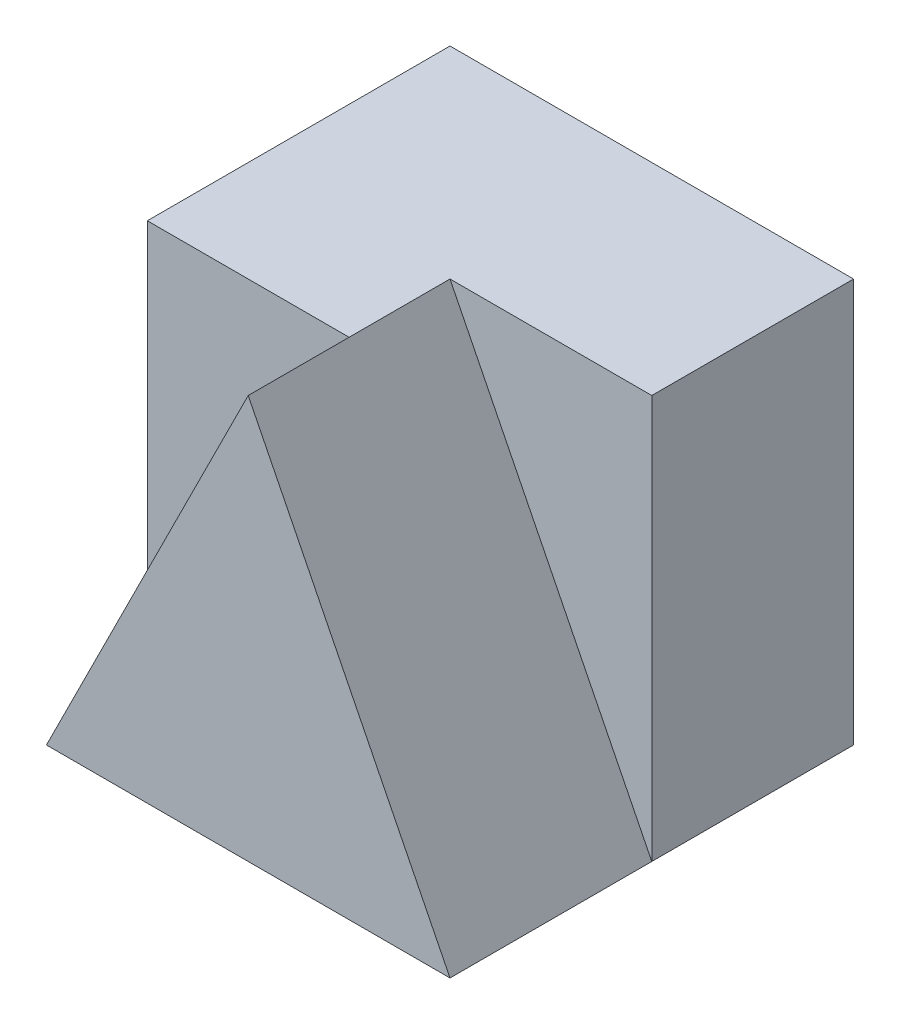
ISO-10303-21;
HEADER;
FILE_DESCRIPTION(('STEP AP214'),'2;1');
FILE_NAME('part.step','',(''),(''),'','','');
FILE_SCHEMA(('AUTOMOTIVE_DESIGN { 1 0 10303 214 1 1 1 1 }'));
ENDSEC;
DATA;
#1=APPLICATION_CONTEXT('core data for automotive mechanical design processes');
#2=APPLICATION_PROTOCOL_DEFINITION('international standard','automotive_design',2000,#1);
#3=PRODUCT_CONTEXT('',#1,'mechanical');
#4=PRODUCT('Part','Part','',(#3));
#5=PRODUCT_RELATED_PRODUCT_CATEGORY('part','',(#4));
#6=PRODUCT_DEFINITION_FORMATION('','',#4);
#7=PRODUCT_DEFINITION_CONTEXT('part definition',#1,'design');
#8=PRODUCT_DEFINITION('design','',#6,#7);
#9=PRODUCT_DEFINITION_SHAPE('','',#8);
#10=(LENGTH_UNIT() NAMED_UNIT(*) SI_UNIT(.MILLI.,.METRE.));
#11=(NAMED_UNIT(*) PLANE_ANGLE_UNIT() SI_UNIT($,.RADIAN.));
#12=(NAMED_UNIT(*) SI_UNIT($,.STERADIAN.) SOLID_ANGLE_UNIT());
#13=UNCERTAINTY_MEASURE_WITH_UNIT(LENGTH_MEASURE(1.E-05),#10,'distance_accuracy_value','');
#14=(GEOMETRIC_REPRESENTATION_CONTEXT(3) GLOBAL_UNCERTAINTY_ASSIGNED_CONTEXT((#13)) GLOBAL_UNIT_ASSIGNED_CONTEXT((#10,
#11,#12)) REPRESENTATION_CONTEXT('',''));
#15=CARTESIAN_POINT('',(0.,0.,0.));
#16=DIRECTION('',(0.,0.,1.));
#17=DIRECTION('',(1.,0.,0.));
#18=AXIS2_PLACEMENT_3D('',#15,#16,#17);
#19=CARTESIAN_POINT('',(-2.,4.,2.));
#20=DIRECTION('',(1.,0.,0.));
#21=DIRECTION('',(0.,0.,-1.));
#22=AXIS2_PLACEMENT_3D('',#19,#20,#21);
#23=PLANE('',#22);
#24=DIRECTION('',(0.,-1.,0.));
#25=VECTOR('',#24,1.);
#26=CARTESIAN_POINT('',(-2.,0.,1.));
#27=LINE('',#26,#25);
#28=CARTESIAN_POINT('',(-2.,4.,1.));
#29=VERTEX_POINT('',#28);
#30=CARTESIAN_POINT('',(-2.,0.,1.));
#31=VERTEX_POINT('',#30);
#32=EDGE_CURVE('E131',#29,#31,#27,.T.);
#33=ORIENTED_EDGE('',*,*,#32,.F.);
#34=DIRECTION('',(0.,0.,1.));
#35=VECTOR('',#34,1.);
#36=CARTESIAN_POINT('',(-2.,4.,2.));
#37=LINE('',#36,#35);
#38=CARTESIAN_POINT('',(-2.,4.,-2.));
#39=VERTEX_POINT('',#38);
#40=EDGE_CURVE('E103',#39,#29,#37,.T.);
#41=ORIENTED_EDGE('',*,*,#40,.F.);
#42=DIRECTION('',(0.,-1.,0.));
#43=VECTOR('',#42,1.);
#44=CARTESIAN_POINT('',(-2.,4.,-2.));
#45=LINE('',#44,#43);
#46=CARTESIAN_POINT('',(-2.,0.,-2.));
#47=VERTEX_POINT('',#46);
#48=EDGE_CURVE('E42',#39,#47,#45,.T.);
#49=ORIENTED_EDGE('',*,*,#48,.T.);
#50=DIRECTION('',(0.,0.,1.));
#51=VECTOR('',#50,1.);
#52=CARTESIAN_POINT('',(-2.,0.,2.));
#53=LINE('',#52,#51);
#54=EDGE_CURVE('E94',#47,#31,#53,.T.);
#55=ORIENTED_EDGE('',*,*,#54,.T.);
#56=EDGE_LOOP('',(#33,#41,#49,#55));
#57=FACE_BOUND('',#56,.T.);
#58=ADVANCED_FACE('F33',(#57),#23,.F.);
#59=CARTESIAN_POINT('',(0.,4.,0.));
#60=DIRECTION('',(0.,-1.,0.));
#61=DIRECTION('',(0.,0.,-1.));
#62=AXIS2_PLACEMENT_3D('',#59,#60,#61);
#63=PLANE('',#62);
#64=DIRECTION('',(-1.,0.,0.));
#65=VECTOR('',#64,1.);
#66=CARTESIAN_POINT('',(-2.,4.,1.));
#67=LINE('',#66,#65);
#68=CARTESIAN_POINT('',(0.,4.,1.));
#69=VERTEX_POINT('',#68);
#70=EDGE_CURVE('E128',#69,#29,#67,.T.);
#71=ORIENTED_EDGE('',*,*,#70,.F.);
#72=DIRECTION('',(0.,0.,1.));
#73=VECTOR('',#72,1.);
#74=CARTESIAN_POINT('',(0.,4.,0.));
#75=LINE('',#74,#73);
#76=CARTESIAN_POINT('',(0.,4.,0.));
#77=VERTEX_POINT('',#76);
#78=EDGE_CURVE('E101',#77,#69,#75,.T.);
#79=ORIENTED_EDGE('',*,*,#78,.F.);
#80=DIRECTION('',(-1.,0.,0.));
#81=VECTOR('',#80,1.);
#82=CARTESIAN_POINT('',(0.,4.,0.));
#83=LINE('',#82,#81);
#84=CARTESIAN_POINT('',(2.,4.,0.));
#85=VERTEX_POINT('',#84);
#86=EDGE_CURVE('E114',#85,#77,#83,.T.);
#87=ORIENTED_EDGE('',*,*,#86,.F.);
#88=DIRECTION('',(0.,0.,-1.));
#89=VECTOR('',#88,1.);
#90=CARTESIAN_POINT('',(2.,4.,2.));
#91=LINE('',#90,#89);
#92=CARTESIAN_POINT('',(2.,4.,-2.));
#93=VERTEX_POINT('',#92);
#94=EDGE_CURVE('E93',#85,#93,#91,.T.);
#95=ORIENTED_EDGE('',*,*,#94,.T.);
#96=DIRECTION('',(-1.,0.,0.));
#97=VECTOR('',#96,1.);
#98=CARTESIAN_POINT('',(-2.,4.,-2.));
#99=LINE('',#98,#97);
#100=EDGE_CURVE('E50',#93,#39,#99,.T.);
#101=ORIENTED_EDGE('',*,*,#100,.T.);
#102=ORIENTED_EDGE('',*,*,#40,.T.);
#103=EDGE_LOOP('',(#71,#79,#87,#95,#101,#102));
#104=FACE_BOUND('',#103,.T.);
#105=ADVANCED_FACE('F157',(#104),#63,.F.);
#106=CARTESIAN_POINT('',(2.,4.,2.));
#107=DIRECTION('',(-1.,0.,0.));
#108=DIRECTION('',(0.,0.,1.));
#109=AXIS2_PLACEMENT_3D('',#106,#107,#108);
#110=PLANE('',#109);
#111=ORIENTED_EDGE('',*,*,#94,.F.);
#112=DIRECTION('',(0.,1.,0.));
#113=VECTOR('',#112,1.);
#114=CARTESIAN_POINT('',(2.,4.,0.));
#115=LINE('',#114,#113);
#116=CARTESIAN_POINT('',(2.,0.,0.));
#117=VERTEX_POINT('',#116);
#118=EDGE_CURVE('E118',#117,#85,#115,.T.);
#119=ORIENTED_EDGE('',*,*,#118,.F.);
#120=DIRECTION('',(0.,0.,-1.));
#121=VECTOR('',#120,1.);
#122=CARTESIAN_POINT('',(2.,0.,2.));
#123=LINE('',#122,#121);
#124=CARTESIAN_POINT('',(2.,0.,-2.));
#125=VERTEX_POINT('',#124);
#126=EDGE_CURVE('E98',#117,#125,#123,.T.);
#127=ORIENTED_EDGE('',*,*,#126,.T.);
#128=DIRECTION('',(0.,-1.,0.));
#129=VECTOR('',#128,1.);
#130=CARTESIAN_POINT('',(2.,4.,-2.));
#131=LINE('',#130,#129);
#132=EDGE_CURVE('E11',#93,#125,#131,.T.);
#133=ORIENTED_EDGE('',*,*,#132,.F.);
#134=EDGE_LOOP('',(#111,#119,#127,#133));
#135=FACE_BOUND('',#134,.T.);
#136=ADVANCED_FACE('F35',(#135),#110,.F.);
#137=CARTESIAN_POINT('',(-2.,4.,-2.));
#138=DIRECTION('',(0.,0.,1.));
#139=DIRECTION('',(1.,0.,0.));
#140=AXIS2_PLACEMENT_3D('',#137,#138,#139);
#141=PLANE('',#140);
#142=DIRECTION('',(-1.,0.,0.));
#143=VECTOR('',#142,1.);
#144=CARTESIAN_POINT('',(-2.,0.,-2.));
#145=LINE('',#144,#143);
#146=EDGE_CURVE('E62',#125,#47,#145,.T.);
#147=ORIENTED_EDGE('',*,*,#146,.T.);
#148=ORIENTED_EDGE('',*,*,#48,.F.);
#149=ORIENTED_EDGE('',*,*,#100,.F.);
#150=ORIENTED_EDGE('',*,*,#132,.T.);
#151=EDGE_LOOP('',(#147,#148,#149,#150));
#152=FACE_BOUND('',#151,.T.);
#153=ADVANCED_FACE('F164',(#152),#141,.F.);
#154=CARTESIAN_POINT('',(-2.,4.,2.));
#155=DIRECTION('',(0.,0.,-1.));
#156=DIRECTION('',(-1.,0.,0.));
#157=AXIS2_PLACEMENT_3D('',#154,#155,#156);
#158=PLANE('',#157);
#159=DIRECTION('',(0.447213595499958,-0.894427190999916,0.));
#160=VECTOR('',#159,1.);
#161=CARTESIAN_POINT('',(2.,0.,2.));
#162=LINE('',#161,#160);
#163=CARTESIAN_POINT('',(0.,4.,2.));
#164=VERTEX_POINT('',#163);
#165=CARTESIAN_POINT('',(2.,0.,2.));
#166=VERTEX_POINT('',#165);
#167=EDGE_CURVE('E69',#164,#166,#162,.T.);
#168=ORIENTED_EDGE('',*,*,#167,.F.);
#169=DIRECTION('',(0.447213595499958,0.894427190999916,0.));
#170=VECTOR('',#169,1.);
#171=CARTESIAN_POINT('',(0.,4.,2.));
#172=LINE('',#171,#170);
#173=CARTESIAN_POINT('',(-2.,0.,2.));
#174=VERTEX_POINT('',#173);
#175=EDGE_CURVE('E90',#174,#164,#172,.T.);
#176=ORIENTED_EDGE('',*,*,#175,.F.);
#177=DIRECTION('',(1.,0.,0.));
#178=VECTOR('',#177,1.);
#179=CARTESIAN_POINT('',(-2.,0.,2.));
#180=LINE('',#179,#178);
#181=EDGE_CURVE('E86',#174,#166,#180,.T.);
#182=ORIENTED_EDGE('',*,*,#181,.T.);
#183=EDGE_LOOP('',(#168,#176,#182));
#184=FACE_BOUND('',#183,.T.);
#185=ADVANCED_FACE('F87',(#184),#158,.F.);
#186=CARTESIAN_POINT('',(0.,0.,0.));
#187=DIRECTION('',(0.,-1.,0.));
#188=DIRECTION('',(0.,0.,-1.));
#189=AXIS2_PLACEMENT_3D('',#186,#187,#188);
#190=PLANE('',#189);
#191=EDGE_CURVE('E75',#166,#117,#123,.T.);
#192=ORIENTED_EDGE('',*,*,#191,.F.);
#193=ORIENTED_EDGE('',*,*,#181,.F.);
#194=DIRECTION('',(0.,0.,1.));
#195=VECTOR('',#194,1.);
#196=CARTESIAN_POINT('',(-2.,0.,1.));
#197=LINE('',#196,#195);
#198=EDGE_CURVE('E122',#31,#174,#197,.T.);
#199=ORIENTED_EDGE('',*,*,#198,.F.);
#200=ORIENTED_EDGE('',*,*,#54,.F.);
#201=ORIENTED_EDGE('',*,*,#146,.F.);
#202=ORIENTED_EDGE('',*,*,#126,.F.);
#203=EDGE_LOOP('',(#192,#193,#199,#200,#201,#202));
#204=FACE_BOUND('',#203,.T.);
#205=ADVANCED_FACE('F97',(#204),#190,.T.);
#206=CARTESIAN_POINT('',(2.,0.,0.));
#207=DIRECTION('',(-0.894427190999916,-0.447213595499958,0.));
#208=DIRECTION('',(0.447213595499958,-0.894427190999916,0.));
#209=AXIS2_PLACEMENT_3D('',#206,#207,#208);
#210=PLANE('',#209);
#211=ORIENTED_EDGE('',*,*,#167,.T.);
#212=ORIENTED_EDGE('',*,*,#191,.T.);
#213=DIRECTION('',(0.447213595499958,-0.894427190999916,0.));
#214=VECTOR('',#213,1.);
#215=CARTESIAN_POINT('',(2.,0.,0.));
#216=LINE('',#215,#214);
#217=EDGE_CURVE('E83',#77,#117,#216,.T.);
#218=ORIENTED_EDGE('',*,*,#217,.F.);
#219=ORIENTED_EDGE('',*,*,#78,.T.);
#220=DIRECTION('',(0.,0.,1.));
#221=VECTOR('',#220,1.);
#222=CARTESIAN_POINT('',(0.,4.,1.));
#223=LINE('',#222,#221);
#224=EDGE_CURVE('E80',#69,#164,#223,.T.);
#225=ORIENTED_EDGE('',*,*,#224,.T.);
#226=EDGE_LOOP('',(#211,#212,#218,#219,#225));
#227=FACE_BOUND('',#226,.T.);
#228=ADVANCED_FACE('F71',(#227),#210,.F.);
#229=CARTESIAN_POINT('',(0.,0.,0.));
#230=DIRECTION('',(0.,0.,-1.));
#231=DIRECTION('',(-1.,0.,0.));
#232=AXIS2_PLACEMENT_3D('',#229,#230,#231);
#233=PLANE('',#232);
#234=ORIENTED_EDGE('',*,*,#217,.T.);
#235=ORIENTED_EDGE('',*,*,#118,.T.);
#236=ORIENTED_EDGE('',*,*,#86,.T.);
#237=EDGE_LOOP('',(#234,#235,#236));
#238=FACE_BOUND('',#237,.T.);
#239=ADVANCED_FACE('F155',(#238),#233,.F.);
#240=CARTESIAN_POINT('',(0.,4.,1.));
#241=DIRECTION('',(0.894427190999916,-0.447213595499958,0.));
#242=DIRECTION('',(0.447213595499958,0.894427190999916,0.));
#243=AXIS2_PLACEMENT_3D('',#240,#241,#242);
#244=PLANE('',#243);
#245=ORIENTED_EDGE('',*,*,#175,.T.);
#246=ORIENTED_EDGE('',*,*,#224,.F.);
#247=DIRECTION('',(0.447213595499958,0.894427190999916,0.));
#248=VECTOR('',#247,1.);
#249=CARTESIAN_POINT('',(0.,4.,1.));
#250=LINE('',#249,#248);
#251=EDGE_CURVE('E125',#31,#69,#250,.T.);
#252=ORIENTED_EDGE('',*,*,#251,.F.);
#253=ORIENTED_EDGE('',*,*,#198,.T.);
#254=EDGE_LOOP('',(#245,#246,#252,#253));
#255=FACE_BOUND('',#254,.T.);
#256=ADVANCED_FACE('F145',(#255),#244,.F.);
#257=CARTESIAN_POINT('',(0.,0.,1.));
#258=DIRECTION('',(0.,0.,1.));
#259=DIRECTION('',(1.,0.,0.));
#260=AXIS2_PLACEMENT_3D('',#257,#258,#259);
#261=PLANE('',#260);
#262=ORIENTED_EDGE('',*,*,#70,.T.);
#263=ORIENTED_EDGE('',*,*,#32,.T.);
#264=ORIENTED_EDGE('',*,*,#251,.T.);
#265=EDGE_LOOP('',(#262,#263,#264));
#266=FACE_BOUND('',#265,.T.);
#267=ADVANCED_FACE('F137',(#266),#261,.T.);
#268=CLOSED_SHELL('',(#58,#105,#136,#153,#185,#205,#228,#239,#256,#267));
#269=MANIFOLD_SOLID_BREP('B2',#268);
#270=ADVANCED_BREP_SHAPE_REPRESENTATION('',(#18,#269),#14);
#271=SHAPE_DEFINITION_REPRESENTATION(#9,#270);
ENDSEC;
END-ISO-10303-21;
